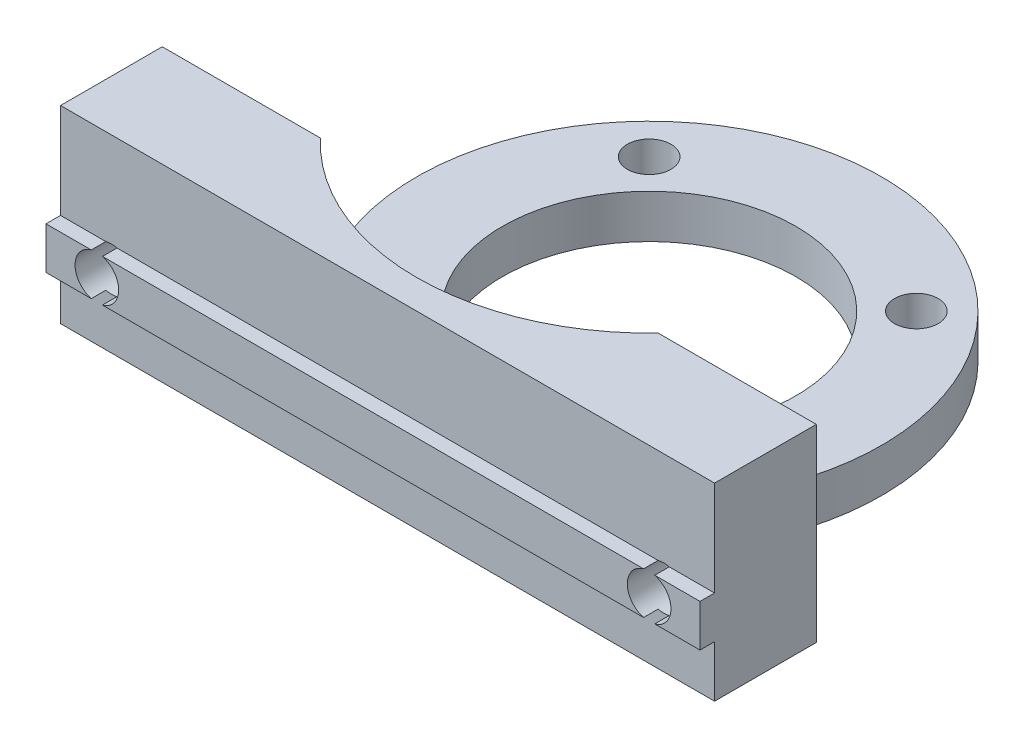
ISO-10303-21;
HEADER;
FILE_DESCRIPTION(('STEP AP214'),'2;1');
FILE_NAME('part.step','',(''),(''),'','','');
FILE_SCHEMA(('AUTOMOTIVE_DESIGN { 1 0 10303 214 1 1 1 1 }'));
ENDSEC;
DATA;
#1=APPLICATION_CONTEXT('core data for automotive mechanical design processes');
#2=APPLICATION_PROTOCOL_DEFINITION('international standard','automotive_design',2000,#1);
#3=PRODUCT_CONTEXT('',#1,'mechanical');
#4=PRODUCT('Part','Part','',(#3));
#5=PRODUCT_RELATED_PRODUCT_CATEGORY('part','',(#4));
#6=PRODUCT_DEFINITION_FORMATION('','',#4);
#7=PRODUCT_DEFINITION_CONTEXT('part definition',#1,'design');
#8=PRODUCT_DEFINITION('design','',#6,#7);
#9=PRODUCT_DEFINITION_SHAPE('','',#8);
#10=(LENGTH_UNIT() NAMED_UNIT(*) SI_UNIT(.MILLI.,.METRE.));
#11=(NAMED_UNIT(*) PLANE_ANGLE_UNIT() SI_UNIT($,.RADIAN.));
#12=(NAMED_UNIT(*) SI_UNIT($,.STERADIAN.) SOLID_ANGLE_UNIT());
#13=UNCERTAINTY_MEASURE_WITH_UNIT(LENGTH_MEASURE(1.E-05),#10,'distance_accuracy_value','');
#14=(GEOMETRIC_REPRESENTATION_CONTEXT(3) GLOBAL_UNCERTAINTY_ASSIGNED_CONTEXT((#13)) GLOBAL_UNIT_ASSIGNED_CONTEXT((#10,
#11,#12)) REPRESENTATION_CONTEXT('',''));
#15=CARTESIAN_POINT('',(0.,0.,0.));
#16=DIRECTION('',(0.,0.,1.));
#17=DIRECTION('',(1.,0.,0.));
#18=AXIS2_PLACEMENT_3D('',#15,#16,#17);
#19=CARTESIAN_POINT('',(0.,0.,0.));
#20=DIRECTION('',(0.,0.,-1.));
#21=DIRECTION('',(-1.,0.,0.));
#22=AXIS2_PLACEMENT_3D('',#19,#20,#21);
#23=PLANE('',#22);
#24=CARTESIAN_POINT('',(-19.,-1.5,0.));
#25=DIRECTION('',(0.,0.,1.));
#26=DIRECTION('',(1.,0.,0.));
#27=AXIS2_PLACEMENT_3D('',#24,#25,#26);
#28=CIRCLE('',#27,1.5);
#29=CARTESIAN_POINT('',(-17.5,-1.5,0.));
#30=VERTEX_POINT('',#29);
#31=EDGE_CURVE('E237',#30,#30,#28,.T.);
#32=ORIENTED_EDGE('',*,*,#31,.T.);
#33=EDGE_LOOP('',(#32));
#34=FACE_BOUND('',#33,.T.);
#35=DIRECTION('',(-1.,0.,0.));
#36=VECTOR('',#35,1.);
#37=CARTESIAN_POINT('',(0.,-3.5,0.));
#38=LINE('',#37,#36);
#39=CARTESIAN_POINT('',(-11.6189500386223,-3.5,0.));
#40=VERTEX_POINT('',#39);
#41=CARTESIAN_POINT('',(-17.2336879396141,-3.5,0.));
#42=VERTEX_POINT('',#41);
#43=EDGE_CURVE('E48',#40,#42,#38,.T.);
#44=ORIENTED_EDGE('',*,*,#43,.T.);
#45=DIRECTION('',(0.,-1.,0.));
#46=VECTOR('',#45,1.);
#47=CARTESIAN_POINT('',(-17.2336879396141,0.,0.));
#48=LINE('',#47,#46);
#49=CARTESIAN_POINT('',(-17.2336879396141,-6.5,0.));
#50=VERTEX_POINT('',#49);
#51=EDGE_CURVE('E355',#42,#50,#48,.T.);
#52=ORIENTED_EDGE('',*,*,#51,.T.);
#53=DIRECTION('',(1.,0.,0.));
#54=VECTOR('',#53,1.);
#55=CARTESIAN_POINT('',(-22.5,-6.5,0.));
#56=LINE('',#55,#54);
#57=CARTESIAN_POINT('',(-22.5,-6.5,0.));
#58=VERTEX_POINT('',#57);
#59=EDGE_CURVE('E317',#58,#50,#56,.T.);
#60=ORIENTED_EDGE('',*,*,#59,.F.);
#61=DIRECTION('',(0.,-1.,0.));
#62=VECTOR('',#61,1.);
#63=CARTESIAN_POINT('',(-22.5,-6.5,0.));
#64=LINE('',#63,#62);
#65=CARTESIAN_POINT('',(-22.5,6.5,0.));
#66=VERTEX_POINT('',#65);
#67=EDGE_CURVE('E314',#66,#58,#64,.T.);
#68=ORIENTED_EDGE('',*,*,#67,.F.);
#69=DIRECTION('',(-1.,0.,0.));
#70=VECTOR('',#69,1.);
#71=CARTESIAN_POINT('',(-22.5,6.5,0.));
#72=LINE('',#71,#70);
#73=CARTESIAN_POINT('',(-11.6189500386223,6.5,0.));
#74=VERTEX_POINT('',#73);
#75=EDGE_CURVE('E311',#74,#66,#72,.T.);
#76=ORIENTED_EDGE('',*,*,#75,.F.);
#77=DIRECTION('',(0.,1.,0.));
#78=VECTOR('',#77,1.);
#79=CARTESIAN_POINT('',(-11.6189500386223,-48.754833995939,0.));
#80=LINE('',#79,#78);
#81=EDGE_CURVE('E197',#74,#40,#80,.F.);
#82=ORIENTED_EDGE('',*,*,#81,.T.);
#83=EDGE_LOOP('',(#44,#52,#60,#68,#76,#82));
#84=FACE_BOUND('',#83,.T.);
#85=ADVANCED_FACE('F33',(#34,#84),#23,.T.);
#86=CARTESIAN_POINT('',(19.,-1.5,0.));
#87=DIRECTION('',(0.,0.,1.));
#88=DIRECTION('',(1.,0.,0.));
#89=AXIS2_PLACEMENT_3D('',#86,#87,#88);
#90=CIRCLE('',#89,1.5);
#91=CARTESIAN_POINT('',(20.5,-1.5,0.));
#92=VERTEX_POINT('',#91);
#93=EDGE_CURVE('E220',#92,#92,#90,.T.);
#94=ORIENTED_EDGE('',*,*,#93,.T.);
#95=EDGE_LOOP('',(#94));
#96=FACE_BOUND('',#95,.T.);
#97=CARTESIAN_POINT('',(17.2336879396141,-6.5,0.));
#98=VERTEX_POINT('',#97);
#99=CARTESIAN_POINT('',(22.5,-6.5,0.));
#100=VERTEX_POINT('',#99);
#101=EDGE_CURVE('E316',#98,#100,#56,.T.);
#102=ORIENTED_EDGE('',*,*,#101,.F.);
#103=DIRECTION('',(0.,-1.,0.));
#104=VECTOR('',#103,1.);
#105=CARTESIAN_POINT('',(17.2336879396141,0.,0.));
#106=LINE('',#105,#104);
#107=CARTESIAN_POINT('',(17.2336879396141,-3.5,0.));
#108=VERTEX_POINT('',#107);
#109=EDGE_CURVE('E188',#98,#108,#106,.F.);
#110=ORIENTED_EDGE('',*,*,#109,.T.);
#111=DIRECTION('',(-1.,0.,0.));
#112=VECTOR('',#111,1.);
#113=CARTESIAN_POINT('',(0.,-3.5,0.));
#114=LINE('',#113,#112);
#115=CARTESIAN_POINT('',(11.6189500386222,-3.5,0.));
#116=VERTEX_POINT('',#115);
#117=EDGE_CURVE('E182',#108,#116,#114,.T.);
#118=ORIENTED_EDGE('',*,*,#117,.T.);
#119=DIRECTION('',(0.,1.,0.));
#120=VECTOR('',#119,1.);
#121=CARTESIAN_POINT('',(11.6189500386223,-48.754833995939,0.));
#122=LINE('',#121,#120);
#123=CARTESIAN_POINT('',(11.6189500386223,6.5,0.));
#124=VERTEX_POINT('',#123);
#125=EDGE_CURVE('E186',#116,#124,#122,.T.);
#126=ORIENTED_EDGE('',*,*,#125,.T.);
#127=CARTESIAN_POINT('',(22.5,6.5,0.));
#128=VERTEX_POINT('',#127);
#129=EDGE_CURVE('E312',#128,#124,#72,.T.);
#130=ORIENTED_EDGE('',*,*,#129,.F.);
#131=DIRECTION('',(0.,1.,0.));
#132=VECTOR('',#131,1.);
#133=CARTESIAN_POINT('',(22.5,-6.5,0.));
#134=LINE('',#133,#132);
#135=EDGE_CURVE('E295',#100,#128,#134,.T.);
#136=ORIENTED_EDGE('',*,*,#135,.F.);
#137=EDGE_LOOP('',(#102,#110,#118,#126,#130,#136));
#138=FACE_BOUND('',#137,.T.);
#139=ADVANCED_FACE('F185',(#96,#138),#23,.T.);
#140=CARTESIAN_POINT('',(-22.5,-0.0500000000000001,8.));
#141=DIRECTION('',(0.,-1.,0.));
#142=DIRECTION('',(0.,0.,-1.));
#143=AXIS2_PLACEMENT_3D('',#140,#141,#142);
#144=PLANE('',#143);
#145=DIRECTION('',(-1.,0.,0.));
#146=VECTOR('',#145,1.);
#147=CARTESIAN_POINT('',(-22.5,-0.0500000000000001,7.));
#148=LINE('',#147,#146);
#149=CARTESIAN_POINT('',(22.5,-0.0500000000000023,7.));
#150=VERTEX_POINT('',#149);
#151=CARTESIAN_POINT('',(19.3840572873934,-0.0500000000000006,7.));
#152=VERTEX_POINT('',#151);
#153=EDGE_CURVE('E263',#150,#152,#148,.T.);
#154=ORIENTED_EDGE('',*,*,#153,.T.);
#155=DIRECTION('',(0.,0.,1.));
#156=VECTOR('',#155,1.);
#157=CARTESIAN_POINT('',(19.3840572873934,-0.0500000000000001,0.));
#158=LINE('',#157,#156);
#159=CARTESIAN_POINT('',(19.3840572873934,-0.0499999999999999,8.));
#160=VERTEX_POINT('',#159);
#161=EDGE_CURVE('E234',#152,#160,#158,.T.);
#162=ORIENTED_EDGE('',*,*,#161,.T.);
#163=DIRECTION('',(-1.,0.,0.));
#164=VECTOR('',#163,1.);
#165=CARTESIAN_POINT('',(-22.5,-0.0500000000000001,8.));
#166=LINE('',#165,#164);
#167=CARTESIAN_POINT('',(22.5,-0.0500000000000001,8.));
#168=VERTEX_POINT('',#167);
#169=EDGE_CURVE('E271',#168,#160,#166,.T.);
#170=ORIENTED_EDGE('',*,*,#169,.F.);
#171=DIRECTION('',(0.,0.,-1.));
#172=VECTOR('',#171,1.);
#173=CARTESIAN_POINT('',(22.5,-0.0500000000000001,8.));
#174=LINE('',#173,#172);
#175=EDGE_CURVE('E286',#168,#150,#174,.T.);
#176=ORIENTED_EDGE('',*,*,#175,.T.);
#177=EDGE_LOOP('',(#154,#162,#170,#176));
#178=FACE_BOUND('',#177,.T.);
#179=ADVANCED_FACE('F411',(#178),#144,.F.);
#180=CARTESIAN_POINT('',(0.,0.,8.));
#181=DIRECTION('',(0.,0.,-1.));
#182=DIRECTION('',(-1.,0.,0.));
#183=AXIS2_PLACEMENT_3D('',#180,#181,#182);
#184=PLANE('',#183);
#185=ORIENTED_EDGE('',*,*,#169,.T.);
#186=CARTESIAN_POINT('',(19.,-1.5,8.));
#187=DIRECTION('',(0.,0.,1.));
#188=DIRECTION('',(1.,0.,0.));
#189=AXIS2_PLACEMENT_3D('',#186,#187,#188);
#190=CIRCLE('',#189,1.5);
#191=CARTESIAN_POINT('',(19.3840572873934,-2.95,8.));
#192=VERTEX_POINT('',#191);
#193=EDGE_CURVE('E217',#192,#160,#190,.T.);
#194=ORIENTED_EDGE('',*,*,#193,.F.);
#195=DIRECTION('',(1.,0.,0.));
#196=VECTOR('',#195,1.);
#197=CARTESIAN_POINT('',(-22.5,-2.95,8.));
#198=LINE('',#197,#196);
#199=CARTESIAN_POINT('',(22.5,-2.95,8.));
#200=VERTEX_POINT('',#199);
#201=EDGE_CURVE('E262',#192,#200,#198,.T.);
#202=ORIENTED_EDGE('',*,*,#201,.T.);
#203=DIRECTION('',(0.,1.,0.));
#204=VECTOR('',#203,1.);
#205=CARTESIAN_POINT('',(22.5,-2.95,8.));
#206=LINE('',#205,#204);
#207=EDGE_CURVE('E267',#200,#168,#206,.T.);
#208=ORIENTED_EDGE('',*,*,#207,.T.);
#209=EDGE_LOOP('',(#185,#194,#202,#208));
#210=FACE_BOUND('',#209,.T.);
#211=ADVANCED_FACE('F414',(#210),#184,.F.);
#212=CARTESIAN_POINT('',(-22.5,-2.95,8.));
#213=DIRECTION('',(0.,1.,0.));
#214=DIRECTION('',(-1.,0.,0.));
#215=AXIS2_PLACEMENT_3D('',#212,#213,#214);
#216=PLANE('',#215);
#217=DIRECTION('',(1.,0.,0.));
#218=VECTOR('',#217,1.);
#219=CARTESIAN_POINT('',(-22.5,-2.95,7.));
#220=LINE('',#219,#218);
#221=CARTESIAN_POINT('',(-18.6159427126066,-2.95,7.));
#222=VERTEX_POINT('',#221);
#223=CARTESIAN_POINT('',(18.6159427126066,-2.95,7.));
#224=VERTEX_POINT('',#223);
#225=EDGE_CURVE('E280',#222,#224,#220,.T.);
#226=ORIENTED_EDGE('',*,*,#225,.T.);
#227=DIRECTION('',(0.,0.,1.));
#228=VECTOR('',#227,1.);
#229=CARTESIAN_POINT('',(18.6159427126066,-2.95,0.));
#230=LINE('',#229,#228);
#231=CARTESIAN_POINT('',(18.6159427126066,-2.95,8.));
#232=VERTEX_POINT('',#231);
#233=EDGE_CURVE('E338',#224,#232,#230,.T.);
#234=ORIENTED_EDGE('',*,*,#233,.T.);
#235=CARTESIAN_POINT('',(-18.6159427126066,-2.95,8.));
#236=VERTEX_POINT('',#235);
#237=EDGE_CURVE('E268',#236,#232,#198,.T.);
#238=ORIENTED_EDGE('',*,*,#237,.F.);
#239=DIRECTION('',(0.,0.,1.));
#240=VECTOR('',#239,1.);
#241=CARTESIAN_POINT('',(-18.6159427126066,-2.95,0.));
#242=LINE('',#241,#240);
#243=EDGE_CURVE('E249',#236,#222,#242,.F.);
#244=ORIENTED_EDGE('',*,*,#243,.T.);
#245=EDGE_LOOP('',(#226,#234,#238,#244));
#246=FACE_BOUND('',#245,.T.);
#247=ADVANCED_FACE('F422',(#246),#216,.F.);
#248=CARTESIAN_POINT('',(-22.5,-2.95,7.));
#249=VERTEX_POINT('',#248);
#250=CARTESIAN_POINT('',(-19.3840572873934,-2.95,7.));
#251=VERTEX_POINT('',#250);
#252=EDGE_CURVE('E276',#249,#251,#220,.T.);
#253=ORIENTED_EDGE('',*,*,#252,.T.);
#254=DIRECTION('',(0.,0.,1.));
#255=VECTOR('',#254,1.);
#256=CARTESIAN_POINT('',(-19.3840572873934,-2.95,0.));
#257=LINE('',#256,#255);
#258=CARTESIAN_POINT('',(-19.3840572873934,-2.95,8.));
#259=VERTEX_POINT('',#258);
#260=EDGE_CURVE('E255',#251,#259,#257,.T.);
#261=ORIENTED_EDGE('',*,*,#260,.T.);
#262=CARTESIAN_POINT('',(-22.5,-2.95,8.));
#263=VERTEX_POINT('',#262);
#264=EDGE_CURVE('E264',#263,#259,#198,.T.);
#265=ORIENTED_EDGE('',*,*,#264,.F.);
#266=DIRECTION('',(0.,0.,-1.));
#267=VECTOR('',#266,1.);
#268=CARTESIAN_POINT('',(-22.5,-2.95,8.));
#269=LINE('',#268,#267);
#270=EDGE_CURVE('E292',#263,#249,#269,.T.);
#271=ORIENTED_EDGE('',*,*,#270,.T.);
#272=EDGE_LOOP('',(#253,#261,#265,#271));
#273=FACE_BOUND('',#272,.T.);
#274=ADVANCED_FACE('F444',(#273),#216,.F.);
#275=CARTESIAN_POINT('',(18.6159427126066,-0.0499999999999999,8.));
#276=VERTEX_POINT('',#275);
#277=CARTESIAN_POINT('',(-18.6159427126066,-0.0499999999999999,8.));
#278=VERTEX_POINT('',#277);
#279=EDGE_CURVE('E275',#276,#278,#166,.T.);
#280=ORIENTED_EDGE('',*,*,#279,.F.);
#281=DIRECTION('',(0.,0.,1.));
#282=VECTOR('',#281,1.);
#283=CARTESIAN_POINT('',(18.6159427126066,-0.0500000000000001,0.));
#284=LINE('',#283,#282);
#285=CARTESIAN_POINT('',(18.6159427126066,-0.0500000000000006,7.));
#286=VERTEX_POINT('',#285);
#287=EDGE_CURVE('E231',#276,#286,#284,.F.);
#288=ORIENTED_EDGE('',*,*,#287,.T.);
#289=CARTESIAN_POINT('',(-18.6159427126066,-0.0500000000000006,7.));
#290=VERTEX_POINT('',#289);
#291=EDGE_CURVE('E283',#286,#290,#148,.T.);
#292=ORIENTED_EDGE('',*,*,#291,.T.);
#293=DIRECTION('',(0.,0.,1.));
#294=VECTOR('',#293,1.);
#295=CARTESIAN_POINT('',(-18.6159427126066,-0.0500000000000001,0.));
#296=LINE('',#295,#294);
#297=EDGE_CURVE('E246',#290,#278,#296,.T.);
#298=ORIENTED_EDGE('',*,*,#297,.T.);
#299=EDGE_LOOP('',(#280,#288,#292,#298));
#300=FACE_BOUND('',#299,.T.);
#301=ADVANCED_FACE('F434',(#300),#144,.F.);
#302=ORIENTED_EDGE('',*,*,#237,.T.);
#303=EDGE_CURVE('E224',#276,#232,#190,.T.);
#304=ORIENTED_EDGE('',*,*,#303,.F.);
#305=ORIENTED_EDGE('',*,*,#279,.T.);
#306=CARTESIAN_POINT('',(-19.,-1.5,8.));
#307=DIRECTION('',(0.,0.,-1.));
#308=DIRECTION('',(-1.,0.,0.));
#309=AXIS2_PLACEMENT_3D('',#306,#307,#308);
#310=CIRCLE('',#309,1.5);
#311=EDGE_CURVE('E334',#278,#236,#310,.T.);
#312=ORIENTED_EDGE('',*,*,#311,.T.);
#313=EDGE_LOOP('',(#302,#304,#305,#312));
#314=FACE_BOUND('',#313,.T.);
#315=ADVANCED_FACE('F430',(#314),#184,.F.);
#316=CARTESIAN_POINT('',(0.,0.,7.));
#317=DIRECTION('',(0.,0.,-1.));
#318=DIRECTION('',(-1.,0.,0.));
#319=AXIS2_PLACEMENT_3D('',#316,#317,#318);
#320=PLANE('',#319);
#321=ORIENTED_EDGE('',*,*,#291,.F.);
#322=CARTESIAN_POINT('',(19.,-1.5,7.));
#323=DIRECTION('',(0.,0.,-1.));
#324=DIRECTION('',(-1.,0.,0.));
#325=AXIS2_PLACEMENT_3D('',#322,#323,#324);
#326=CIRCLE('',#325,1.5);
#327=EDGE_CURVE('E228',#286,#152,#326,.T.);
#328=ORIENTED_EDGE('',*,*,#327,.T.);
#329=ORIENTED_EDGE('',*,*,#153,.F.);
#330=DIRECTION('',(0.,1.,0.));
#331=VECTOR('',#330,1.);
#332=CARTESIAN_POINT('',(22.5,-6.5,7.));
#333=LINE('',#332,#331);
#334=CARTESIAN_POINT('',(22.5,6.5,7.));
#335=VERTEX_POINT('',#334);
#336=EDGE_CURVE('E300',#150,#335,#333,.T.);
#337=ORIENTED_EDGE('',*,*,#336,.T.);
#338=DIRECTION('',(-1.,0.,0.));
#339=VECTOR('',#338,1.);
#340=CARTESIAN_POINT('',(-22.5,6.5,7.));
#341=LINE('',#340,#339);
#342=CARTESIAN_POINT('',(-22.5,6.5,7.));
#343=VERTEX_POINT('',#342);
#344=EDGE_CURVE('E299',#335,#343,#341,.T.);
#345=ORIENTED_EDGE('',*,*,#344,.T.);
#346=DIRECTION('',(0.,-1.,0.));
#347=VECTOR('',#346,1.);
#348=CARTESIAN_POINT('',(-22.5,-6.5,7.));
#349=LINE('',#348,#347);
#350=CARTESIAN_POINT('',(-22.5,-0.0500000000000023,7.));
#351=VERTEX_POINT('',#350);
#352=EDGE_CURVE('E303',#343,#351,#349,.T.);
#353=ORIENTED_EDGE('',*,*,#352,.T.);
#354=CARTESIAN_POINT('',(-19.3840572873934,-0.0500000000000001,7.));
#355=VERTEX_POINT('',#354);
#356=EDGE_CURVE('E279',#355,#351,#148,.T.);
#357=ORIENTED_EDGE('',*,*,#356,.F.);
#358=CARTESIAN_POINT('',(-19.,-1.5,7.));
#359=DIRECTION('',(0.,0.,-1.));
#360=DIRECTION('',(-1.,0.,0.));
#361=AXIS2_PLACEMENT_3D('',#358,#359,#360);
#362=CIRCLE('',#361,1.5);
#363=EDGE_CURVE('E243',#355,#290,#362,.T.);
#364=ORIENTED_EDGE('',*,*,#363,.T.);
#365=EDGE_LOOP('',(#321,#328,#329,#337,#345,#353,#357,#364));
#366=FACE_BOUND('',#365,.T.);
#367=ADVANCED_FACE('F405',(#366),#320,.F.);
#368=CARTESIAN_POINT('',(19.3840572873934,-2.95,7.));
#369=VERTEX_POINT('',#368);
#370=CARTESIAN_POINT('',(22.5,-2.95,7.));
#371=VERTEX_POINT('',#370);
#372=EDGE_CURVE('E258',#369,#371,#220,.T.);
#373=ORIENTED_EDGE('',*,*,#372,.F.);
#374=CARTESIAN_POINT('',(19.,-1.5,7.));
#375=DIRECTION('',(0.,0.,-1.));
#376=DIRECTION('',(-1.,0.,0.));
#377=AXIS2_PLACEMENT_3D('',#374,#375,#376);
#378=CIRCLE('',#377,1.5);
#379=EDGE_CURVE('E223',#369,#224,#378,.T.);
#380=ORIENTED_EDGE('',*,*,#379,.T.);
#381=ORIENTED_EDGE('',*,*,#225,.F.);
#382=CARTESIAN_POINT('',(-19.,-1.5,7.));
#383=DIRECTION('',(0.,0.,-1.));
#384=DIRECTION('',(-1.,0.,0.));
#385=AXIS2_PLACEMENT_3D('',#382,#383,#384);
#386=CIRCLE('',#385,1.5);
#387=EDGE_CURVE('E252',#222,#251,#386,.T.);
#388=ORIENTED_EDGE('',*,*,#387,.T.);
#389=ORIENTED_EDGE('',*,*,#252,.F.);
#390=CARTESIAN_POINT('',(-22.5,-6.5,7.));
#391=VERTEX_POINT('',#390);
#392=EDGE_CURVE('E302',#249,#391,#349,.T.);
#393=ORIENTED_EDGE('',*,*,#392,.T.);
#394=DIRECTION('',(1.,0.,0.));
#395=VECTOR('',#394,1.);
#396=CARTESIAN_POINT('',(-22.5,-6.5,7.));
#397=LINE('',#396,#395);
#398=CARTESIAN_POINT('',(22.5,-6.5,7.));
#399=VERTEX_POINT('',#398);
#400=EDGE_CURVE('E306',#391,#399,#397,.T.);
#401=ORIENTED_EDGE('',*,*,#400,.T.);
#402=EDGE_CURVE('E296',#399,#371,#333,.T.);
#403=ORIENTED_EDGE('',*,*,#402,.T.);
#404=EDGE_LOOP('',(#373,#380,#381,#388,#389,#393,#401,#403));
#405=FACE_BOUND('',#404,.T.);
#406=ADVANCED_FACE('F387',(#405),#320,.F.);
#407=CARTESIAN_POINT('',(22.5,-6.5,7.));
#408=DIRECTION('',(-1.,0.,0.));
#409=DIRECTION('',(0.,0.,1.));
#410=AXIS2_PLACEMENT_3D('',#407,#408,#409);
#411=PLANE('',#410);
#412=ORIENTED_EDGE('',*,*,#135,.T.);
#413=DIRECTION('',(0.,0.,-1.));
#414=VECTOR('',#413,1.);
#415=CARTESIAN_POINT('',(22.5,6.5,7.));
#416=LINE('',#415,#414);
#417=EDGE_CURVE('E328',#335,#128,#416,.T.);
#418=ORIENTED_EDGE('',*,*,#417,.F.);
#419=ORIENTED_EDGE('',*,*,#336,.F.);
#420=ORIENTED_EDGE('',*,*,#175,.F.);
#421=ORIENTED_EDGE('',*,*,#207,.F.);
#422=DIRECTION('',(0.,0.,-1.));
#423=VECTOR('',#422,1.);
#424=CARTESIAN_POINT('',(22.5,-2.95,8.));
#425=LINE('',#424,#423);
#426=EDGE_CURVE('E289',#200,#371,#425,.T.);
#427=ORIENTED_EDGE('',*,*,#426,.T.);
#428=ORIENTED_EDGE('',*,*,#402,.F.);
#429=DIRECTION('',(0.,0.,-1.));
#430=VECTOR('',#429,1.);
#431=CARTESIAN_POINT('',(22.5,-6.5,7.));
#432=LINE('',#431,#430);
#433=EDGE_CURVE('E308',#399,#100,#432,.T.);
#434=ORIENTED_EDGE('',*,*,#433,.T.);
#435=EDGE_LOOP('',(#412,#418,#419,#420,#421,#427,#428,#434));
#436=FACE_BOUND('',#435,.T.);
#437=ADVANCED_FACE('F379',(#436),#411,.F.);
#438=CARTESIAN_POINT('',(-22.5,6.5,7.));
#439=DIRECTION('',(0.,-1.,0.));
#440=DIRECTION('',(0.,0.,-1.));
#441=AXIS2_PLACEMENT_3D('',#438,#439,#440);
#442=PLANE('',#441);
#443=CARTESIAN_POINT('',(0.,6.5,-11.));
#444=DIRECTION('',(0.,-1.,0.));
#445=DIRECTION('',(0.,0.,-1.));
#446=AXIS2_PLACEMENT_3D('',#443,#444,#445);
#447=CIRCLE('',#446,16.);
#448=EDGE_CURVE('E196',#124,#74,#447,.T.);
#449=ORIENTED_EDGE('',*,*,#448,.T.);
#450=ORIENTED_EDGE('',*,*,#75,.T.);
#451=DIRECTION('',(0.,0.,-1.));
#452=VECTOR('',#451,1.);
#453=CARTESIAN_POINT('',(-22.5,6.5,7.));
#454=LINE('',#453,#452);
#455=EDGE_CURVE('E325',#343,#66,#454,.T.);
#456=ORIENTED_EDGE('',*,*,#455,.F.);
#457=ORIENTED_EDGE('',*,*,#344,.F.);
#458=ORIENTED_EDGE('',*,*,#417,.T.);
#459=ORIENTED_EDGE('',*,*,#129,.T.);
#460=EDGE_LOOP('',(#449,#450,#456,#457,#458,#459));
#461=FACE_BOUND('',#460,.T.);
#462=ADVANCED_FACE('F401',(#461),#442,.F.);
#463=CARTESIAN_POINT('',(-22.5,-6.5,7.));
#464=DIRECTION('',(1.,0.,0.));
#465=DIRECTION('',(0.,0.,-1.));
#466=AXIS2_PLACEMENT_3D('',#463,#464,#465);
#467=PLANE('',#466);
#468=ORIENTED_EDGE('',*,*,#67,.T.);
#469=DIRECTION('',(0.,0.,-1.));
#470=VECTOR('',#469,1.);
#471=CARTESIAN_POINT('',(-22.5,-6.5,7.));
#472=LINE('',#471,#470);
#473=EDGE_CURVE('E322',#391,#58,#472,.T.);
#474=ORIENTED_EDGE('',*,*,#473,.F.);
#475=ORIENTED_EDGE('',*,*,#392,.F.);
#476=ORIENTED_EDGE('',*,*,#270,.F.);
#477=DIRECTION('',(0.,-1.,0.));
#478=VECTOR('',#477,1.);
#479=CARTESIAN_POINT('',(-22.5,-2.95,8.));
#480=LINE('',#479,#478);
#481=CARTESIAN_POINT('',(-22.5,-0.0500000000000001,8.));
#482=VERTEX_POINT('',#481);
#483=EDGE_CURVE('E259',#482,#263,#480,.T.);
#484=ORIENTED_EDGE('',*,*,#483,.F.);
#485=DIRECTION('',(0.,0.,-1.));
#486=VECTOR('',#485,1.);
#487=CARTESIAN_POINT('',(-22.5,-0.0500000000000001,8.));
#488=LINE('',#487,#486);
#489=EDGE_CURVE('E274',#482,#351,#488,.T.);
#490=ORIENTED_EDGE('',*,*,#489,.T.);
#491=ORIENTED_EDGE('',*,*,#352,.F.);
#492=ORIENTED_EDGE('',*,*,#455,.T.);
#493=EDGE_LOOP('',(#468,#474,#475,#476,#484,#490,#491,#492));
#494=FACE_BOUND('',#493,.T.);
#495=ADVANCED_FACE('F391',(#494),#467,.F.);
#496=CARTESIAN_POINT('',(-22.5,-6.5,7.));
#497=DIRECTION('',(0.,1.,0.));
#498=DIRECTION('',(0.,0.,1.));
#499=AXIS2_PLACEMENT_3D('',#496,#497,#498);
#500=PLANE('',#499);
#501=CARTESIAN_POINT('',(-9.19238815542512,-6.5,-20.1923881554251));
#502=DIRECTION('',(0.,1.,0.));
#503=DIRECTION('',(0.,0.,1.));
#504=AXIS2_PLACEMENT_3D('',#501,#502,#503);
#505=CIRCLE('',#504,1.5);
#506=CARTESIAN_POINT('',(-9.19238815542512,-6.5,-18.6923881554251));
#507=VERTEX_POINT('',#506);
#508=EDGE_CURVE('E348',#507,#507,#505,.T.);
#509=ORIENTED_EDGE('',*,*,#508,.T.);
#510=EDGE_LOOP('',(#509));
#511=FACE_BOUND('',#510,.T.);
#512=CARTESIAN_POINT('',(-9.19238815542512,-6.5,-1.80761184457488));
#513=DIRECTION('',(0.,1.,0.));
#514=DIRECTION('',(0.,0.,1.));
#515=AXIS2_PLACEMENT_3D('',#512,#513,#514);
#516=CIRCLE('',#515,1.5);
#517=CARTESIAN_POINT('',(-9.19238815542512,-6.5,-0.307611844574884));
#518=VERTEX_POINT('',#517);
#519=EDGE_CURVE('E714',#518,#518,#516,.T.);
#520=ORIENTED_EDGE('',*,*,#519,.T.);
#521=EDGE_LOOP('',(#520));
#522=FACE_BOUND('',#521,.T.);
#523=CARTESIAN_POINT('',(9.19238815542512,-6.5,-1.80761184457488));
#524=DIRECTION('',(0.,1.,0.));
#525=DIRECTION('',(0.,0.,1.));
#526=AXIS2_PLACEMENT_3D('',#523,#524,#525);
#527=CIRCLE('',#526,1.5);
#528=CARTESIAN_POINT('',(9.19238815542512,-6.5,-0.307611844574885));
#529=VERTEX_POINT('',#528);
#530=EDGE_CURVE('E711',#529,#529,#527,.T.);
#531=ORIENTED_EDGE('',*,*,#530,.T.);
#532=EDGE_LOOP('',(#531));
#533=FACE_BOUND('',#532,.T.);
#534=CARTESIAN_POINT('',(9.19238815542512,-6.5,-20.1923881554251));
#535=DIRECTION('',(0.,1.,0.));
#536=DIRECTION('',(0.,0.,1.));
#537=AXIS2_PLACEMENT_3D('',#534,#535,#536);
#538=CIRCLE('',#537,1.5);
#539=CARTESIAN_POINT('',(9.19238815542512,-6.5,-18.6923881554251));
#540=VERTEX_POINT('',#539);
#541=EDGE_CURVE('E343',#540,#540,#538,.T.);
#542=ORIENTED_EDGE('',*,*,#541,.T.);
#543=EDGE_LOOP('',(#542));
#544=FACE_BOUND('',#543,.T.);
#545=ORIENTED_EDGE('',*,*,#59,.T.);
#546=CARTESIAN_POINT('',(-17.2336879396141,-6.5,-3.));
#547=DIRECTION('',(0.,1.,0.));
#548=DIRECTION('',(0.,0.,1.));
#549=AXIS2_PLACEMENT_3D('',#546,#547,#548);
#550=CIRCLE('',#549,3.);
#551=CARTESIAN_POINT('',(-14.5125793175698,-6.5,-4.26315789473684));
#552=VERTEX_POINT('',#551);
#553=EDGE_CURVE('E362',#50,#552,#550,.T.);
#554=ORIENTED_EDGE('',*,*,#553,.T.);
#555=CARTESIAN_POINT('',(0.,-6.5,-11.));
#556=DIRECTION('',(0.,1.,0.));
#557=DIRECTION('',(0.,0.,1.));
#558=AXIS2_PLACEMENT_3D('',#555,#556,#557);
#559=CIRCLE('',#558,16.);
#560=CARTESIAN_POINT('',(14.5125793175698,-6.5,-4.26315789473684));
#561=VERTEX_POINT('',#560);
#562=EDGE_CURVE('E211',#561,#552,#559,.T.);
#563=ORIENTED_EDGE('',*,*,#562,.F.);
#564=CARTESIAN_POINT('',(17.2336879396141,-6.5,-3.));
#565=DIRECTION('',(0.,1.,0.));
#566=DIRECTION('',(0.,0.,1.));
#567=AXIS2_PLACEMENT_3D('',#564,#565,#566);
#568=CIRCLE('',#567,3.);
#569=EDGE_CURVE('E11',#561,#98,#568,.T.);
#570=ORIENTED_EDGE('',*,*,#569,.T.);
#571=ORIENTED_EDGE('',*,*,#101,.T.);
#572=ORIENTED_EDGE('',*,*,#433,.F.);
#573=ORIENTED_EDGE('',*,*,#400,.F.);
#574=ORIENTED_EDGE('',*,*,#473,.T.);
#575=EDGE_LOOP('',(#545,#554,#563,#570,#571,#572,#573,#574));
#576=FACE_BOUND('',#575,.T.);
#577=CARTESIAN_POINT('',(0.,-6.5,-11.));
#578=DIRECTION('',(0.,1.,0.));
#579=DIRECTION('',(0.,0.,1.));
#580=AXIS2_PLACEMENT_3D('',#577,#578,#579);
#581=CIRCLE('',#580,10.1);
#582=CARTESIAN_POINT('',(0.,-6.5,-0.899999999999998));
#583=VERTEX_POINT('',#582);
#584=EDGE_CURVE('E207',#583,#583,#581,.T.);
#585=ORIENTED_EDGE('',*,*,#584,.T.);
#586=EDGE_LOOP('',(#585));
#587=FACE_BOUND('',#586,.T.);
#588=ADVANCED_FACE('F373',(#511,#522,#533,#544,#576,#587),#500,.F.);
#589=ORIENTED_EDGE('',*,*,#201,.F.);
#590=DIRECTION('',(0.,0.,1.));
#591=VECTOR('',#590,1.);
#592=CARTESIAN_POINT('',(19.3840572873934,-2.95,0.));
#593=LINE('',#592,#591);
#594=EDGE_CURVE('E335',#192,#369,#593,.F.);
#595=ORIENTED_EDGE('',*,*,#594,.T.);
#596=ORIENTED_EDGE('',*,*,#372,.T.);
#597=ORIENTED_EDGE('',*,*,#426,.F.);
#598=EDGE_LOOP('',(#589,#595,#596,#597));
#599=FACE_BOUND('',#598,.T.);
#600=ADVANCED_FACE('F418',(#599),#216,.F.);
#601=CARTESIAN_POINT('',(-19.3840572873934,-0.0500000000000006,8.));
#602=VERTEX_POINT('',#601);
#603=EDGE_CURVE('E270',#602,#482,#166,.T.);
#604=ORIENTED_EDGE('',*,*,#603,.F.);
#605=DIRECTION('',(0.,0.,1.));
#606=VECTOR('',#605,1.);
#607=CARTESIAN_POINT('',(-19.3840572873934,-0.0500000000000001,0.));
#608=LINE('',#607,#606);
#609=EDGE_CURVE('E240',#602,#355,#608,.F.);
#610=ORIENTED_EDGE('',*,*,#609,.T.);
#611=ORIENTED_EDGE('',*,*,#356,.T.);
#612=ORIENTED_EDGE('',*,*,#489,.F.);
#613=EDGE_LOOP('',(#604,#610,#611,#612));
#614=FACE_BOUND('',#613,.T.);
#615=ADVANCED_FACE('F442',(#614),#144,.F.);
#616=ORIENTED_EDGE('',*,*,#264,.T.);
#617=EDGE_CURVE('E331',#259,#602,#310,.T.);
#618=ORIENTED_EDGE('',*,*,#617,.T.);
#619=ORIENTED_EDGE('',*,*,#603,.T.);
#620=ORIENTED_EDGE('',*,*,#483,.T.);
#621=EDGE_LOOP('',(#616,#618,#619,#620));
#622=FACE_BOUND('',#621,.T.);
#623=ADVANCED_FACE('F439',(#622),#184,.F.);
#624=CARTESIAN_POINT('',(-19.,-1.5,0.));
#625=DIRECTION('',(0.,0.,1.));
#626=DIRECTION('',(1.,0.,0.));
#627=AXIS2_PLACEMENT_3D('',#624,#625,#626);
#628=CYLINDRICAL_SURFACE('',#627,1.5);
#629=ORIENTED_EDGE('',*,*,#31,.F.);
#630=EDGE_LOOP('',(#629));
#631=FACE_BOUND('',#630,.T.);
#632=ORIENTED_EDGE('',*,*,#387,.F.);
#633=ORIENTED_EDGE('',*,*,#243,.F.);
#634=ORIENTED_EDGE('',*,*,#311,.F.);
#635=ORIENTED_EDGE('',*,*,#297,.F.);
#636=ORIENTED_EDGE('',*,*,#363,.F.);
#637=ORIENTED_EDGE('',*,*,#609,.F.);
#638=ORIENTED_EDGE('',*,*,#617,.F.);
#639=ORIENTED_EDGE('',*,*,#260,.F.);
#640=EDGE_LOOP('',(#632,#633,#634,#635,#636,#637,#638,#639));
#641=FACE_BOUND('',#640,.T.);
#642=ADVANCED_FACE('F446',(#631,#641),#628,.F.);
#643=CARTESIAN_POINT('',(19.,-1.5,0.));
#644=DIRECTION('',(0.,0.,1.));
#645=DIRECTION('',(1.,0.,0.));
#646=AXIS2_PLACEMENT_3D('',#643,#644,#645);
#647=CYLINDRICAL_SURFACE('',#646,1.5);
#648=ORIENTED_EDGE('',*,*,#93,.F.);
#649=EDGE_LOOP('',(#648));
#650=FACE_BOUND('',#649,.T.);
#651=ORIENTED_EDGE('',*,*,#327,.F.);
#652=ORIENTED_EDGE('',*,*,#287,.F.);
#653=ORIENTED_EDGE('',*,*,#303,.T.);
#654=ORIENTED_EDGE('',*,*,#233,.F.);
#655=ORIENTED_EDGE('',*,*,#379,.F.);
#656=ORIENTED_EDGE('',*,*,#594,.F.);
#657=ORIENTED_EDGE('',*,*,#193,.T.);
#658=ORIENTED_EDGE('',*,*,#161,.F.);
#659=EDGE_LOOP('',(#651,#652,#653,#654,#655,#656,#657,#658));
#660=FACE_BOUND('',#659,.T.);
#661=ADVANCED_FACE('F426',(#650,#660),#647,.F.);
#662=CARTESIAN_POINT('',(0.,-3.5,-11.));
#663=DIRECTION('',(0.,1.,0.));
#664=DIRECTION('',(0.,0.,1.));
#665=AXIS2_PLACEMENT_3D('',#662,#663,#664);
#666=PLANE('',#665);
#667=CARTESIAN_POINT('',(-9.19238815542512,-3.5,-20.1923881554251));
#668=DIRECTION('',(0.,1.,0.));
#669=DIRECTION('',(0.,0.,1.));
#670=AXIS2_PLACEMENT_3D('',#667,#668,#669);
#671=CIRCLE('',#670,1.5);
#672=CARTESIAN_POINT('',(-9.19238815542512,-3.5,-18.6923881554251));
#673=VERTEX_POINT('',#672);
#674=EDGE_CURVE('E351',#673,#673,#671,.T.);
#675=ORIENTED_EDGE('',*,*,#674,.F.);
#676=EDGE_LOOP('',(#675));
#677=FACE_BOUND('',#676,.T.);
#678=CARTESIAN_POINT('',(-9.19238815542512,-3.5,-1.80761184457488));
#679=DIRECTION('',(0.,1.,0.));
#680=DIRECTION('',(0.,0.,1.));
#681=AXIS2_PLACEMENT_3D('',#678,#679,#680);
#682=CIRCLE('',#681,1.5);
#683=CARTESIAN_POINT('',(-9.19238815542512,-3.5,-0.307611844574884));
#684=VERTEX_POINT('',#683);
#685=EDGE_CURVE('E347',#684,#684,#682,.T.);
#686=ORIENTED_EDGE('',*,*,#685,.F.);
#687=EDGE_LOOP('',(#686));
#688=FACE_BOUND('',#687,.T.);
#689=CARTESIAN_POINT('',(9.19238815542512,-3.5,-1.80761184457488));
#690=DIRECTION('',(0.,1.,0.));
#691=DIRECTION('',(0.,0.,1.));
#692=AXIS2_PLACEMENT_3D('',#689,#690,#691);
#693=CIRCLE('',#692,1.5);
#694=CARTESIAN_POINT('',(9.19238815542512,-3.5,-0.307611844574885));
#695=VERTEX_POINT('',#694);
#696=EDGE_CURVE('E344',#695,#695,#693,.T.);
#697=ORIENTED_EDGE('',*,*,#696,.F.);
#698=EDGE_LOOP('',(#697));
#699=FACE_BOUND('',#698,.T.);
#700=CARTESIAN_POINT('',(9.19238815542512,-3.5,-20.1923881554251));
#701=DIRECTION('',(0.,1.,0.));
#702=DIRECTION('',(0.,0.,1.));
#703=AXIS2_PLACEMENT_3D('',#700,#701,#702);
#704=CIRCLE('',#703,1.5);
#705=CARTESIAN_POINT('',(9.19238815542512,-3.5,-18.6923881554251));
#706=VERTEX_POINT('',#705);
#707=EDGE_CURVE('E202',#706,#706,#704,.T.);
#708=ORIENTED_EDGE('',*,*,#707,.F.);
#709=EDGE_LOOP('',(#708));
#710=FACE_BOUND('',#709,.T.);
#711=CARTESIAN_POINT('',(0.,-3.5,-11.));
#712=DIRECTION('',(0.,1.,0.));
#713=DIRECTION('',(0.,0.,1.));
#714=AXIS2_PLACEMENT_3D('',#711,#712,#713);
#715=CIRCLE('',#714,16.);
#716=EDGE_CURVE('E194',#40,#116,#715,.T.);
#717=ORIENTED_EDGE('',*,*,#716,.T.);
#718=ORIENTED_EDGE('',*,*,#117,.F.);
#719=CARTESIAN_POINT('',(17.2336879396141,-3.5,-3.));
#720=DIRECTION('',(0.,1.,0.));
#721=DIRECTION('',(0.,0.,1.));
#722=AXIS2_PLACEMENT_3D('',#719,#720,#721);
#723=CIRCLE('',#722,3.);
#724=CARTESIAN_POINT('',(14.5125793175698,-3.5,-4.26315789473684));
#725=VERTEX_POINT('',#724);
#726=EDGE_CURVE('E41',#108,#725,#723,.F.);
#727=ORIENTED_EDGE('',*,*,#726,.T.);
#728=CARTESIAN_POINT('',(0.,-3.5,-11.));
#729=DIRECTION('',(0.,1.,0.));
#730=DIRECTION('',(0.,0.,1.));
#731=AXIS2_PLACEMENT_3D('',#728,#729,#730);
#732=CIRCLE('',#731,16.);
#733=CARTESIAN_POINT('',(-14.5125793175698,-3.5,-4.26315789473684));
#734=VERTEX_POINT('',#733);
#735=EDGE_CURVE('E214',#725,#734,#732,.T.);
#736=ORIENTED_EDGE('',*,*,#735,.T.);
#737=CARTESIAN_POINT('',(-17.2336879396141,-3.5,-3.));
#738=DIRECTION('',(0.,1.,0.));
#739=DIRECTION('',(0.,0.,1.));
#740=AXIS2_PLACEMENT_3D('',#737,#738,#739);
#741=CIRCLE('',#740,3.);
#742=EDGE_CURVE('E364',#734,#42,#741,.F.);
#743=ORIENTED_EDGE('',*,*,#742,.T.);
#744=ORIENTED_EDGE('',*,*,#43,.F.);
#745=EDGE_LOOP('',(#717,#718,#727,#736,#743,#744));
#746=FACE_BOUND('',#745,.T.);
#747=CARTESIAN_POINT('',(0.,-3.5,-11.));
#748=DIRECTION('',(0.,1.,0.));
#749=DIRECTION('',(0.,0.,1.));
#750=AXIS2_PLACEMENT_3D('',#747,#748,#749);
#751=CIRCLE('',#750,10.1);
#752=CARTESIAN_POINT('',(0.,-3.5,-0.899999999999998));
#753=VERTEX_POINT('',#752);
#754=EDGE_CURVE('E208',#753,#753,#751,.T.);
#755=ORIENTED_EDGE('',*,*,#754,.F.);
#756=EDGE_LOOP('',(#755));
#757=FACE_BOUND('',#756,.T.);
#758=ADVANCED_FACE('F199',(#677,#688,#699,#710,#746,#757),#666,.T.);
#759=CARTESIAN_POINT('',(0.,-3.5,-11.));
#760=DIRECTION('',(0.,-1.,0.));
#761=DIRECTION('',(0.,0.,-1.));
#762=AXIS2_PLACEMENT_3D('',#759,#760,#761);
#763=CYLINDRICAL_SURFACE('',#762,16.);
#764=ORIENTED_EDGE('',*,*,#562,.T.);
#765=DIRECTION('',(0.,-1.,0.));
#766=VECTOR('',#765,1.);
#767=CARTESIAN_POINT('',(-14.5125793175698,-3.5,-4.26315789473684));
#768=LINE('',#767,#766);
#769=EDGE_CURVE('E189',#552,#734,#768,.F.);
#770=ORIENTED_EDGE('',*,*,#769,.T.);
#771=ORIENTED_EDGE('',*,*,#735,.F.);
#772=DIRECTION('',(0.,-1.,0.));
#773=VECTOR('',#772,1.);
#774=CARTESIAN_POINT('',(14.5125793175698,-3.5,-4.26315789473684));
#775=LINE('',#774,#773);
#776=EDGE_CURVE('E358',#725,#561,#775,.T.);
#777=ORIENTED_EDGE('',*,*,#776,.T.);
#778=EDGE_LOOP('',(#764,#770,#771,#777));
#779=FACE_BOUND('',#778,.T.);
#780=ADVANCED_FACE('F368',(#779),#763,.T.);
#781=CARTESIAN_POINT('',(0.,-3.5,-11.));
#782=DIRECTION('',(0.,-1.,0.));
#783=DIRECTION('',(0.,0.,-1.));
#784=AXIS2_PLACEMENT_3D('',#781,#782,#783);
#785=CYLINDRICAL_SURFACE('',#784,10.1);
#786=ORIENTED_EDGE('',*,*,#754,.T.);
#787=EDGE_LOOP('',(#786));
#788=FACE_BOUND('',#787,.T.);
#789=ORIENTED_EDGE('',*,*,#584,.F.);
#790=EDGE_LOOP('',(#789));
#791=FACE_BOUND('',#790,.T.);
#792=ADVANCED_FACE('F502',(#788,#791),#785,.F.);
#793=CARTESIAN_POINT('',(0.,-48.754833995939,-11.));
#794=DIRECTION('',(0.,1.,0.));
#795=DIRECTION('',(0.,0.,1.));
#796=AXIS2_PLACEMENT_3D('',#793,#794,#795);
#797=CYLINDRICAL_SURFACE('',#796,16.);
#798=ORIENTED_EDGE('',*,*,#448,.F.);
#799=ORIENTED_EDGE('',*,*,#125,.F.);
#800=ORIENTED_EDGE('',*,*,#716,.F.);
#801=ORIENTED_EDGE('',*,*,#81,.F.);
#802=EDGE_LOOP('',(#798,#799,#800,#801));
#803=FACE_BOUND('',#802,.T.);
#804=ADVANCED_FACE('F193',(#803),#797,.F.);
#805=CARTESIAN_POINT('',(9.19238815542512,-6.5,-20.1923881554251));
#806=DIRECTION('',(0.,1.,0.));
#807=DIRECTION('',(0.,0.,1.));
#808=AXIS2_PLACEMENT_3D('',#805,#806,#807);
#809=CYLINDRICAL_SURFACE('',#808,1.5);
#810=ORIENTED_EDGE('',*,*,#707,.T.);
#811=EDGE_LOOP('',(#810));
#812=FACE_BOUND('',#811,.T.);
#813=ORIENTED_EDGE('',*,*,#541,.F.);
#814=EDGE_LOOP('',(#813));
#815=FACE_BOUND('',#814,.T.);
#816=ADVANCED_FACE('F495',(#812,#815),#809,.F.);
#817=CARTESIAN_POINT('',(9.19238815542512,-6.5,-1.80761184457488));
#818=DIRECTION('',(0.,1.,0.));
#819=DIRECTION('',(0.,0.,1.));
#820=AXIS2_PLACEMENT_3D('',#817,#818,#819);
#821=CYLINDRICAL_SURFACE('',#820,1.5);
#822=ORIENTED_EDGE('',*,*,#696,.T.);
#823=EDGE_LOOP('',(#822));
#824=FACE_BOUND('',#823,.T.);
#825=ORIENTED_EDGE('',*,*,#530,.F.);
#826=EDGE_LOOP('',(#825));
#827=FACE_BOUND('',#826,.T.);
#828=ADVANCED_FACE('F488',(#824,#827),#821,.F.);
#829=CARTESIAN_POINT('',(-9.19238815542512,-6.5,-1.80761184457488));
#830=DIRECTION('',(0.,1.,0.));
#831=DIRECTION('',(0.,0.,1.));
#832=AXIS2_PLACEMENT_3D('',#829,#830,#831);
#833=CYLINDRICAL_SURFACE('',#832,1.5);
#834=ORIENTED_EDGE('',*,*,#685,.T.);
#835=EDGE_LOOP('',(#834));
#836=FACE_BOUND('',#835,.T.);
#837=ORIENTED_EDGE('',*,*,#519,.F.);
#838=EDGE_LOOP('',(#837));
#839=FACE_BOUND('',#838,.T.);
#840=ADVANCED_FACE('F482',(#836,#839),#833,.F.);
#841=CARTESIAN_POINT('',(-9.19238815542512,-6.5,-20.1923881554251));
#842=DIRECTION('',(0.,1.,0.));
#843=DIRECTION('',(0.,0.,1.));
#844=AXIS2_PLACEMENT_3D('',#841,#842,#843);
#845=CYLINDRICAL_SURFACE('',#844,1.5);
#846=ORIENTED_EDGE('',*,*,#674,.T.);
#847=EDGE_LOOP('',(#846));
#848=FACE_BOUND('',#847,.T.);
#849=ORIENTED_EDGE('',*,*,#508,.F.);
#850=EDGE_LOOP('',(#849));
#851=FACE_BOUND('',#850,.T.);
#852=ADVANCED_FACE('F477',(#848,#851),#845,.F.);
#853=CARTESIAN_POINT('',(-17.2336879396141,-3.5,-3.));
#854=DIRECTION('',(0.,-1.,0.));
#855=DIRECTION('',(0.,0.,-1.));
#856=AXIS2_PLACEMENT_3D('',#853,#854,#855);
#857=CYLINDRICAL_SURFACE('',#856,3.);
#858=ORIENTED_EDGE('',*,*,#742,.F.);
#859=ORIENTED_EDGE('',*,*,#769,.F.);
#860=ORIENTED_EDGE('',*,*,#553,.F.);
#861=ORIENTED_EDGE('',*,*,#51,.F.);
#862=EDGE_LOOP('',(#858,#859,#860,#861));
#863=FACE_BOUND('',#862,.T.);
#864=ADVANCED_FACE('F399',(#863),#857,.F.);
#865=CARTESIAN_POINT('',(17.2336879396141,-3.5,-3.));
#866=DIRECTION('',(0.,-1.,0.));
#867=DIRECTION('',(0.,0.,-1.));
#868=AXIS2_PLACEMENT_3D('',#865,#866,#867);
#869=CYLINDRICAL_SURFACE('',#868,3.);
#870=ORIENTED_EDGE('',*,*,#569,.F.);
#871=ORIENTED_EDGE('',*,*,#776,.F.);
#872=ORIENTED_EDGE('',*,*,#726,.F.);
#873=ORIENTED_EDGE('',*,*,#109,.F.);
#874=EDGE_LOOP('',(#870,#871,#872,#873));
#875=FACE_BOUND('',#874,.T.);
#876=ADVANCED_FACE('F35',(#875),#869,.F.);
#877=CLOSED_SHELL('',(#85,#139,#179,#211,#247,#274,#301,#315,#367,#406,#437,#462,#495,#588,#600,
#615,#623,#642,#661,#758,#780,#792,#804,#816,#828,#840,#852,#864,#876));
#878=MANIFOLD_SOLID_BREP('B2',#877);
#879=ADVANCED_BREP_SHAPE_REPRESENTATION('',(#18,#878),#14);
#880=SHAPE_DEFINITION_REPRESENTATION(#9,#879);
ENDSEC;
END-ISO-10303-21;
